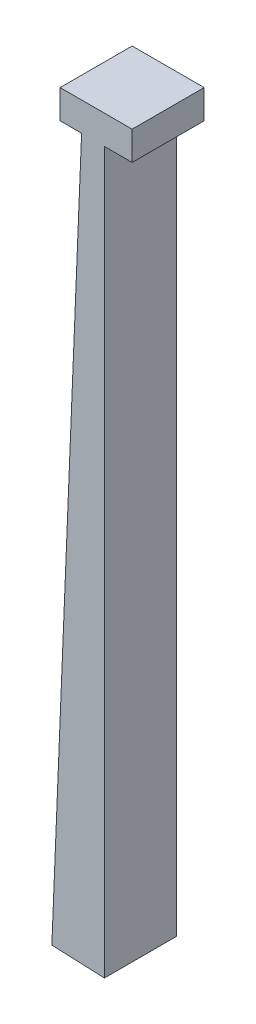
ISO-10303-21;
HEADER;
FILE_DESCRIPTION(('STEP AP214'),'2;1');
FILE_NAME('part.step','',(''),(''),'','','');
FILE_SCHEMA(('AUTOMOTIVE_DESIGN { 1 0 10303 214 1 1 1 1 }'));
ENDSEC;
DATA;
#1=APPLICATION_CONTEXT('core data for automotive mechanical design processes');
#2=APPLICATION_PROTOCOL_DEFINITION('international standard','automotive_design',2000,#1);
#3=PRODUCT_CONTEXT('',#1,'mechanical');
#4=PRODUCT('Part','Part','',(#3));
#5=PRODUCT_RELATED_PRODUCT_CATEGORY('part','',(#4));
#6=PRODUCT_DEFINITION_FORMATION('','',#4);
#7=PRODUCT_DEFINITION_CONTEXT('part definition',#1,'design');
#8=PRODUCT_DEFINITION('design','',#6,#7);
#9=PRODUCT_DEFINITION_SHAPE('','',#8);
#10=(LENGTH_UNIT() NAMED_UNIT(*) SI_UNIT(.MILLI.,.METRE.));
#11=(NAMED_UNIT(*) PLANE_ANGLE_UNIT() SI_UNIT($,.RADIAN.));
#12=(NAMED_UNIT(*) SI_UNIT($,.STERADIAN.) SOLID_ANGLE_UNIT());
#13=UNCERTAINTY_MEASURE_WITH_UNIT(LENGTH_MEASURE(1.E-05),#10,'distance_accuracy_value','');
#14=(GEOMETRIC_REPRESENTATION_CONTEXT(3) GLOBAL_UNCERTAINTY_ASSIGNED_CONTEXT((#13)) GLOBAL_UNIT_ASSIGNED_CONTEXT((#10,
#11,#12)) REPRESENTATION_CONTEXT('',''));
#15=CARTESIAN_POINT('',(0.,0.,0.));
#16=DIRECTION('',(0.,0.,1.));
#17=DIRECTION('',(1.,0.,0.));
#18=AXIS2_PLACEMENT_3D('',#15,#16,#17);
#19=CARTESIAN_POINT('',(-16.7854385508127,-404.951767555578,50.));
#20=DIRECTION('',(0.0414149006742381,0.999142034949057,0.));
#21=DIRECTION('',(-0.999142034949057,0.0414149006742381,0.));
#22=AXIS2_PLACEMENT_3D('',#19,#20,#21);
#23=PLANE('',#22);
#24=DIRECTION('',(0.999142034949057,-0.0414149006742381,0.));
#25=VECTOR('',#24,1.);
#26=CARTESIAN_POINT('',(-16.7854385508127,-404.951767555578,0.));
#27=LINE('',#26,#25);
#28=CARTESIAN_POINT('',(-21.448677420109,-404.758474141992,0.));
#29=VERTEX_POINT('',#28);
#30=CARTESIAN_POINT('',(15.0551862903628,-406.271576220489,0.));
#31=VERTEX_POINT('',#30);
#32=EDGE_CURVE('E171',#29,#31,#27,.T.);
#33=ORIENTED_EDGE('',*,*,#32,.T.);
#34=DIRECTION('',(0.,0.,-1.));
#35=VECTOR('',#34,1.);
#36=CARTESIAN_POINT('',(15.0551862903628,-406.271576220489,50.));
#37=LINE('',#36,#35);
#38=CARTESIAN_POINT('',(15.0551862903628,-406.271576220489,50.));
#39=VERTEX_POINT('',#38);
#40=EDGE_CURVE('E11',#39,#31,#37,.T.);
#41=ORIENTED_EDGE('',*,*,#40,.F.);
#42=DIRECTION('',(0.999142034949057,-0.0414149006742381,0.));
#43=VECTOR('',#42,1.);
#44=CARTESIAN_POINT('',(-16.7854385508127,-404.951767555578,50.));
#45=LINE('',#44,#43);
#46=CARTESIAN_POINT('',(-21.448677420109,-404.758474141992,50.));
#47=VERTEX_POINT('',#46);
#48=EDGE_CURVE('E140',#47,#39,#45,.T.);
#49=ORIENTED_EDGE('',*,*,#48,.F.);
#50=DIRECTION('',(0.,0.,-1.));
#51=VECTOR('',#50,1.);
#52=CARTESIAN_POINT('',(-21.448677420109,-404.758474141992,50.));
#53=LINE('',#52,#51);
#54=EDGE_CURVE('E132',#47,#29,#53,.T.);
#55=ORIENTED_EDGE('',*,*,#54,.T.);
#56=EDGE_LOOP('',(#33,#41,#49,#55));
#57=FACE_BOUND('',#56,.T.);
#58=ADVANCED_FACE('F39',(#57),#23,.F.);
#59=CARTESIAN_POINT('',(15.0551862903628,0.,50.));
#60=DIRECTION('',(-1.,0.,0.));
#61=DIRECTION('',(0.,0.,1.));
#62=AXIS2_PLACEMENT_3D('',#59,#60,#61);
#63=PLANE('',#62);
#64=DIRECTION('',(0.,1.,0.));
#65=VECTOR('',#64,1.);
#66=CARTESIAN_POINT('',(15.0551862903628,0.,0.));
#67=LINE('',#66,#65);
#68=CARTESIAN_POINT('',(15.0551862903628,93.7284237795109,0.));
#69=VERTEX_POINT('',#68);
#70=EDGE_CURVE('E165',#31,#69,#67,.T.);
#71=ORIENTED_EDGE('',*,*,#70,.T.);
#72=DIRECTION('',(0.,0.,-1.));
#73=VECTOR('',#72,1.);
#74=CARTESIAN_POINT('',(15.0551862903628,93.7284237795109,50.));
#75=LINE('',#74,#73);
#76=CARTESIAN_POINT('',(15.0551862903628,93.7284237795109,50.));
#77=VERTEX_POINT('',#76);
#78=EDGE_CURVE('E47',#77,#69,#75,.T.);
#79=ORIENTED_EDGE('',*,*,#78,.F.);
#80=DIRECTION('',(0.,1.,0.));
#81=VECTOR('',#80,1.);
#82=CARTESIAN_POINT('',(15.0551862903628,0.,50.));
#83=LINE('',#82,#81);
#84=EDGE_CURVE('E98',#39,#77,#83,.T.);
#85=ORIENTED_EDGE('',*,*,#84,.F.);
#86=ORIENTED_EDGE('',*,*,#40,.T.);
#87=EDGE_LOOP('',(#71,#79,#85,#86));
#88=FACE_BOUND('',#87,.T.);
#89=ADVANCED_FACE('F186',(#88),#63,.F.);
#90=CARTESIAN_POINT('',(0.,93.7284237795109,50.));
#91=DIRECTION('',(0.,1.,0.));
#92=DIRECTION('',(0.,0.,1.));
#93=AXIS2_PLACEMENT_3D('',#90,#91,#92);
#94=PLANE('',#93);
#95=DIRECTION('',(1.,0.,0.));
#96=VECTOR('',#95,1.);
#97=CARTESIAN_POINT('',(0.,93.7284237795109,0.));
#98=LINE('',#97,#96);
#99=CARTESIAN_POINT('',(34.2960477624277,93.7284237795109,0.));
#100=VERTEX_POINT('',#99);
#101=EDGE_CURVE('E146',#69,#100,#98,.T.);
#102=ORIENTED_EDGE('',*,*,#101,.T.);
#103=DIRECTION('',(0.,0.,-1.));
#104=VECTOR('',#103,1.);
#105=CARTESIAN_POINT('',(34.2960477624277,93.7284237795109,50.));
#106=LINE('',#105,#104);
#107=CARTESIAN_POINT('',(34.2960477624277,93.7284237795109,50.));
#108=VERTEX_POINT('',#107);
#109=EDGE_CURVE('E155',#108,#100,#106,.T.);
#110=ORIENTED_EDGE('',*,*,#109,.F.);
#111=DIRECTION('',(1.,0.,0.));
#112=VECTOR('',#111,1.);
#113=CARTESIAN_POINT('',(0.,93.7284237795109,50.));
#114=LINE('',#113,#112);
#115=EDGE_CURVE('E131',#77,#108,#114,.T.);
#116=ORIENTED_EDGE('',*,*,#115,.F.);
#117=ORIENTED_EDGE('',*,*,#78,.T.);
#118=EDGE_LOOP('',(#102,#110,#116,#117));
#119=FACE_BOUND('',#118,.T.);
#120=ADVANCED_FACE('F160',(#119),#94,.F.);
#121=CARTESIAN_POINT('',(34.2960477624277,0.,50.));
#122=DIRECTION('',(1.,0.,0.));
#123=DIRECTION('',(0.,1.,0.));
#124=AXIS2_PLACEMENT_3D('',#121,#122,#123);
#125=PLANE('',#124);
#126=DIRECTION('',(0.,-1.,0.));
#127=VECTOR('',#126,1.);
#128=CARTESIAN_POINT('',(34.2960477624277,0.,0.));
#129=LINE('',#128,#127);
#130=CARTESIAN_POINT('',(34.2960477624277,113.728423779511,0.));
#131=VERTEX_POINT('',#130);
#132=EDGE_CURVE('E168',#131,#100,#129,.T.);
#133=ORIENTED_EDGE('',*,*,#132,.F.);
#134=DIRECTION('',(0.,0.,-1.));
#135=VECTOR('',#134,1.);
#136=CARTESIAN_POINT('',(34.2960477624277,113.728423779511,50.));
#137=LINE('',#136,#135);
#138=CARTESIAN_POINT('',(34.2960477624277,113.728423779511,50.));
#139=VERTEX_POINT('',#138);
#140=EDGE_CURVE('E153',#139,#131,#137,.T.);
#141=ORIENTED_EDGE('',*,*,#140,.F.);
#142=DIRECTION('',(0.,-1.,0.));
#143=VECTOR('',#142,1.);
#144=CARTESIAN_POINT('',(34.2960477624277,0.,50.));
#145=LINE('',#144,#143);
#146=EDGE_CURVE('E136',#139,#108,#145,.T.);
#147=ORIENTED_EDGE('',*,*,#146,.T.);
#148=ORIENTED_EDGE('',*,*,#109,.T.);
#149=EDGE_LOOP('',(#133,#141,#147,#148));
#150=FACE_BOUND('',#149,.T.);
#151=ADVANCED_FACE('F178',(#150),#125,.T.);
#152=CARTESIAN_POINT('',(0.,113.728423779511,50.));
#153=DIRECTION('',(0.,1.,0.));
#154=DIRECTION('',(0.,0.,1.));
#155=AXIS2_PLACEMENT_3D('',#152,#153,#154);
#156=PLANE('',#155);
#157=DIRECTION('',(1.,0.,0.));
#158=VECTOR('',#157,1.);
#159=CARTESIAN_POINT('',(0.,113.728423779511,0.));
#160=LINE('',#159,#158);
#161=CARTESIAN_POINT('',(-15.7039522375723,113.728423779511,0.));
#162=VERTEX_POINT('',#161);
#163=EDGE_CURVE('E169',#162,#131,#160,.T.);
#164=ORIENTED_EDGE('',*,*,#163,.F.);
#165=DIRECTION('',(0.,0.,-1.));
#166=VECTOR('',#165,1.);
#167=CARTESIAN_POINT('',(-15.7039522375723,113.728423779511,50.));
#168=LINE('',#167,#166);
#169=CARTESIAN_POINT('',(-15.7039522375723,113.728423779511,50.));
#170=VERTEX_POINT('',#169);
#171=EDGE_CURVE('E126',#170,#162,#168,.T.);
#172=ORIENTED_EDGE('',*,*,#171,.F.);
#173=DIRECTION('',(1.,0.,0.));
#174=VECTOR('',#173,1.);
#175=CARTESIAN_POINT('',(0.,113.728423779511,50.));
#176=LINE('',#175,#174);
#177=EDGE_CURVE('E119',#170,#139,#176,.T.);
#178=ORIENTED_EDGE('',*,*,#177,.T.);
#179=ORIENTED_EDGE('',*,*,#140,.T.);
#180=EDGE_LOOP('',(#164,#172,#178,#179));
#181=FACE_BOUND('',#180,.T.);
#182=ADVANCED_FACE('F176',(#181),#156,.T.);
#183=CARTESIAN_POINT('',(-15.7039522375723,0.,50.));
#184=DIRECTION('',(1.,0.,0.));
#185=DIRECTION('',(0.,1.,0.));
#186=AXIS2_PLACEMENT_3D('',#183,#184,#185);
#187=PLANE('',#186);
#188=DIRECTION('',(0.,-1.,0.));
#189=VECTOR('',#188,1.);
#190=CARTESIAN_POINT('',(-15.7039522375723,0.,0.));
#191=LINE('',#190,#189);
#192=CARTESIAN_POINT('',(-15.7039522375723,93.7284237795109,0.));
#193=VERTEX_POINT('',#192);
#194=EDGE_CURVE('E125',#162,#193,#191,.T.);
#195=ORIENTED_EDGE('',*,*,#194,.T.);
#196=DIRECTION('',(0.,0.,-1.));
#197=VECTOR('',#196,1.);
#198=CARTESIAN_POINT('',(-15.7039522375723,93.7284237795109,50.));
#199=LINE('',#198,#197);
#200=CARTESIAN_POINT('',(-15.7039522375723,93.7284237795109,50.));
#201=VERTEX_POINT('',#200);
#202=EDGE_CURVE('E122',#201,#193,#199,.T.);
#203=ORIENTED_EDGE('',*,*,#202,.F.);
#204=DIRECTION('',(0.,-1.,0.));
#205=VECTOR('',#204,1.);
#206=CARTESIAN_POINT('',(-15.7039522375723,0.,50.));
#207=LINE('',#206,#205);
#208=EDGE_CURVE('E112',#170,#201,#207,.T.);
#209=ORIENTED_EDGE('',*,*,#208,.F.);
#210=ORIENTED_EDGE('',*,*,#171,.T.);
#211=EDGE_LOOP('',(#195,#203,#209,#210));
#212=FACE_BOUND('',#211,.T.);
#213=ADVANCED_FACE('F123',(#212),#187,.F.);
#214=CARTESIAN_POINT('',(-0.786164341194463,93.7284237795109,0.));
#215=VERTEX_POINT('',#214);
#216=EDGE_CURVE('E84',#193,#215,#98,.T.);
#217=ORIENTED_EDGE('',*,*,#216,.T.);
#218=DIRECTION('',(0.,0.,-1.));
#219=VECTOR('',#218,1.);
#220=CARTESIAN_POINT('',(-0.786164341194463,93.7284237795109,50.));
#221=LINE('',#220,#219);
#222=CARTESIAN_POINT('',(-0.786164341194463,93.7284237795109,50.));
#223=VERTEX_POINT('',#222);
#224=EDGE_CURVE('E127',#223,#215,#221,.T.);
#225=ORIENTED_EDGE('',*,*,#224,.F.);
#226=EDGE_CURVE('E116',#201,#223,#114,.T.);
#227=ORIENTED_EDGE('',*,*,#226,.F.);
#228=ORIENTED_EDGE('',*,*,#202,.T.);
#229=EDGE_LOOP('',(#217,#225,#227,#228));
#230=FACE_BOUND('',#229,.T.);
#231=ADVANCED_FACE('F129',(#230),#94,.F.);
#232=CARTESIAN_POINT('',(-4.6632388692962,0.193293413585583,50.));
#233=DIRECTION('',(0.999142034949057,-0.0414149006742382,0.));
#234=DIRECTION('',(0.0414149006742382,0.999142034949057,0.));
#235=AXIS2_PLACEMENT_3D('',#232,#233,#234);
#236=PLANE('',#235);
#237=DIRECTION('',(-0.0414149006742382,-0.999142034949057,0.));
#238=VECTOR('',#237,1.);
#239=CARTESIAN_POINT('',(-4.6632388692962,0.193293413585583,0.));
#240=LINE('',#239,#238);
#241=EDGE_CURVE('E90',#215,#29,#240,.T.);
#242=ORIENTED_EDGE('',*,*,#241,.T.);
#243=ORIENTED_EDGE('',*,*,#54,.F.);
#244=DIRECTION('',(-0.0414149006742382,-0.999142034949057,0.));
#245=VECTOR('',#244,1.);
#246=CARTESIAN_POINT('',(-4.6632388692962,0.193293413585583,50.));
#247=LINE('',#246,#245);
#248=EDGE_CURVE('E55',#223,#47,#247,.T.);
#249=ORIENTED_EDGE('',*,*,#248,.F.);
#250=ORIENTED_EDGE('',*,*,#224,.T.);
#251=EDGE_LOOP('',(#242,#243,#249,#250));
#252=FACE_BOUND('',#251,.T.);
#253=ADVANCED_FACE('F195',(#252),#236,.F.);
#254=CARTESIAN_POINT('',(0.,0.,50.));
#255=DIRECTION('',(0.,0.,1.));
#256=DIRECTION('',(1.,0.,0.));
#257=AXIS2_PLACEMENT_3D('',#254,#255,#256);
#258=PLANE('',#257);
#259=ORIENTED_EDGE('',*,*,#48,.T.);
#260=ORIENTED_EDGE('',*,*,#84,.T.);
#261=ORIENTED_EDGE('',*,*,#115,.T.);
#262=ORIENTED_EDGE('',*,*,#146,.F.);
#263=ORIENTED_EDGE('',*,*,#177,.F.);
#264=ORIENTED_EDGE('',*,*,#208,.T.);
#265=ORIENTED_EDGE('',*,*,#226,.T.);
#266=ORIENTED_EDGE('',*,*,#248,.T.);
#267=EDGE_LOOP('',(#259,#260,#261,#262,#263,#264,#265,#266));
#268=FACE_BOUND('',#267,.T.);
#269=ADVANCED_FACE('F114',(#268),#258,.T.);
#270=CARTESIAN_POINT('',(0.,0.,0.));
#271=DIRECTION('',(0.,0.,1.));
#272=DIRECTION('',(1.,0.,0.));
#273=AXIS2_PLACEMENT_3D('',#270,#271,#272);
#274=PLANE('',#273);
#275=ORIENTED_EDGE('',*,*,#32,.F.);
#276=ORIENTED_EDGE('',*,*,#241,.F.);
#277=ORIENTED_EDGE('',*,*,#216,.F.);
#278=ORIENTED_EDGE('',*,*,#194,.F.);
#279=ORIENTED_EDGE('',*,*,#163,.T.);
#280=ORIENTED_EDGE('',*,*,#132,.T.);
#281=ORIENTED_EDGE('',*,*,#101,.F.);
#282=ORIENTED_EDGE('',*,*,#70,.F.);
#283=EDGE_LOOP('',(#275,#276,#277,#278,#279,#280,#281,#282));
#284=FACE_BOUND('',#283,.T.);
#285=ADVANCED_FACE('F164',(#284),#274,.F.);
#286=CLOSED_SHELL('',(#58,#89,#120,#151,#182,#213,#231,#253,#269,#285));
#287=MANIFOLD_SOLID_BREP('B2',#286);
#288=ADVANCED_BREP_SHAPE_REPRESENTATION('',(#18,#287),#14);
#289=SHAPE_DEFINITION_REPRESENTATION(#9,#288);
ENDSEC;
END-ISO-10303-21;
